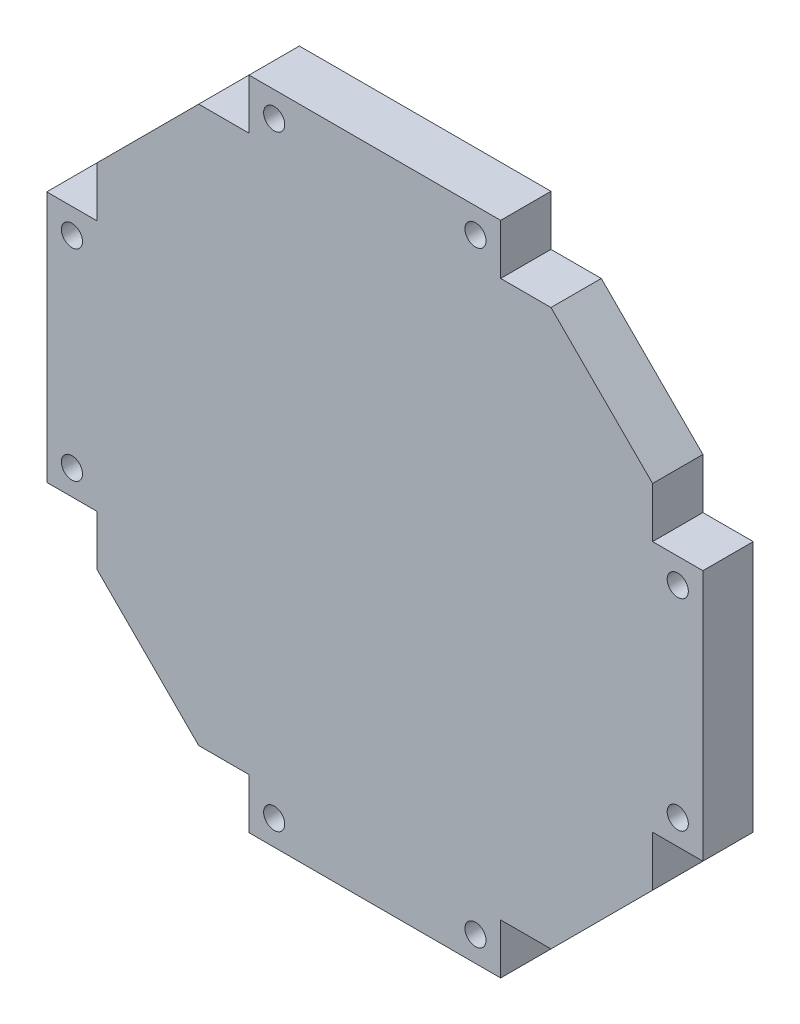
ISO-10303-21;
HEADER;
FILE_DESCRIPTION(('STEP AP214'),'2;1');
FILE_NAME('part.step','',(''),(''),'','','');
FILE_SCHEMA(('AUTOMOTIVE_DESIGN { 1 0 10303 214 1 1 1 1 }'));
ENDSEC;
DATA;
#1=APPLICATION_CONTEXT('core data for automotive mechanical design processes');
#2=APPLICATION_PROTOCOL_DEFINITION('international standard','automotive_design',2000,#1);
#3=PRODUCT_CONTEXT('',#1,'mechanical');
#4=PRODUCT('Part','Part','',(#3));
#5=PRODUCT_RELATED_PRODUCT_CATEGORY('part','',(#4));
#6=PRODUCT_DEFINITION_FORMATION('','',#4);
#7=PRODUCT_DEFINITION_CONTEXT('part definition',#1,'design');
#8=PRODUCT_DEFINITION('design','',#6,#7);
#9=PRODUCT_DEFINITION_SHAPE('','',#8);
#10=(LENGTH_UNIT() NAMED_UNIT(*) SI_UNIT(.MILLI.,.METRE.));
#11=(NAMED_UNIT(*) PLANE_ANGLE_UNIT() SI_UNIT($,.RADIAN.));
#12=(NAMED_UNIT(*) SI_UNIT($,.STERADIAN.) SOLID_ANGLE_UNIT());
#13=UNCERTAINTY_MEASURE_WITH_UNIT(LENGTH_MEASURE(1.E-05),#10,'distance_accuracy_value','');
#14=(GEOMETRIC_REPRESENTATION_CONTEXT(3) GLOBAL_UNCERTAINTY_ASSIGNED_CONTEXT((#13)) GLOBAL_UNIT_ASSIGNED_CONTEXT((#10,
#11,#12)) REPRESENTATION_CONTEXT('',''));
#15=CARTESIAN_POINT('',(0.,0.,0.));
#16=DIRECTION('',(0.,0.,1.));
#17=DIRECTION('',(1.,0.,0.));
#18=AXIS2_PLACEMENT_3D('',#15,#16,#17);
#19=CARTESIAN_POINT('',(0.,0.,10.));
#20=DIRECTION('',(0.,0.,1.));
#21=DIRECTION('',(1.,0.,0.));
#22=AXIS2_PLACEMENT_3D('',#19,#20,#21);
#23=PLANE('',#22);
#24=CARTESIAN_POINT('',(-20.,60.19,10.));
#25=DIRECTION('',(0.,0.,-1.));
#26=DIRECTION('',(-1.,0.,0.));
#27=AXIS2_PLACEMENT_3D('',#24,#25,#26);
#28=CIRCLE('',#27,2.1);
#29=CARTESIAN_POINT('',(-22.1,60.19,10.));
#30=VERTEX_POINT('',#29);
#31=EDGE_CURVE('E227',#30,#30,#28,.T.);
#32=ORIENTED_EDGE('',*,*,#31,.T.);
#33=EDGE_LOOP('',(#32));
#34=FACE_BOUND('',#33,.T.);
#35=CARTESIAN_POINT('',(20.,-60.19,10.));
#36=DIRECTION('',(0.,0.,-1.));
#37=DIRECTION('',(-1.,0.,0.));
#38=AXIS2_PLACEMENT_3D('',#35,#36,#37);
#39=CIRCLE('',#38,2.1);
#40=CARTESIAN_POINT('',(17.9,-60.19,10.));
#41=VERTEX_POINT('',#40);
#42=EDGE_CURVE('E230',#41,#41,#39,.T.);
#43=ORIENTED_EDGE('',*,*,#42,.T.);
#44=EDGE_LOOP('',(#43));
#45=FACE_BOUND('',#44,.T.);
#46=CARTESIAN_POINT('',(-60.19,20.,10.));
#47=DIRECTION('',(0.,0.,-1.));
#48=DIRECTION('',(-1.,0.,0.));
#49=AXIS2_PLACEMENT_3D('',#46,#47,#48);
#50=CIRCLE('',#49,2.1);
#51=CARTESIAN_POINT('',(-62.29,20.,10.));
#52=VERTEX_POINT('',#51);
#53=EDGE_CURVE('E233',#52,#52,#50,.T.);
#54=ORIENTED_EDGE('',*,*,#53,.T.);
#55=EDGE_LOOP('',(#54));
#56=FACE_BOUND('',#55,.T.);
#57=CARTESIAN_POINT('',(60.19,-20.,10.));
#58=DIRECTION('',(0.,0.,-1.));
#59=DIRECTION('',(-1.,0.,0.));
#60=AXIS2_PLACEMENT_3D('',#57,#58,#59);
#61=CIRCLE('',#60,2.1);
#62=CARTESIAN_POINT('',(58.09,-20.,10.));
#63=VERTEX_POINT('',#62);
#64=EDGE_CURVE('E236',#63,#63,#61,.T.);
#65=ORIENTED_EDGE('',*,*,#64,.T.);
#66=EDGE_LOOP('',(#65));
#67=FACE_BOUND('',#66,.T.);
#68=CARTESIAN_POINT('',(20.,60.19,10.));
#69=DIRECTION('',(0.,0.,-1.));
#70=DIRECTION('',(-1.,0.,0.));
#71=AXIS2_PLACEMENT_3D('',#68,#69,#70);
#72=CIRCLE('',#71,2.1);
#73=CARTESIAN_POINT('',(17.9,60.19,10.));
#74=VERTEX_POINT('',#73);
#75=EDGE_CURVE('E239',#74,#74,#72,.T.);
#76=ORIENTED_EDGE('',*,*,#75,.T.);
#77=EDGE_LOOP('',(#76));
#78=FACE_BOUND('',#77,.T.);
#79=CARTESIAN_POINT('',(-20.,-60.19,10.));
#80=DIRECTION('',(0.,0.,-1.));
#81=DIRECTION('',(-1.,0.,0.));
#82=AXIS2_PLACEMENT_3D('',#79,#80,#81);
#83=CIRCLE('',#82,2.1);
#84=CARTESIAN_POINT('',(-22.1,-60.19,10.));
#85=VERTEX_POINT('',#84);
#86=EDGE_CURVE('E242',#85,#85,#83,.T.);
#87=ORIENTED_EDGE('',*,*,#86,.T.);
#88=EDGE_LOOP('',(#87));
#89=FACE_BOUND('',#88,.T.);
#90=CARTESIAN_POINT('',(-60.19,-20.,10.));
#91=DIRECTION('',(0.,0.,-1.));
#92=DIRECTION('',(-1.,0.,0.));
#93=AXIS2_PLACEMENT_3D('',#90,#91,#92);
#94=CIRCLE('',#93,2.1);
#95=CARTESIAN_POINT('',(-62.29,-20.,10.));
#96=VERTEX_POINT('',#95);
#97=EDGE_CURVE('E244',#96,#96,#94,.T.);
#98=ORIENTED_EDGE('',*,*,#97,.T.);
#99=EDGE_LOOP('',(#98));
#100=FACE_BOUND('',#99,.T.);
#101=CARTESIAN_POINT('',(60.19,20.,10.));
#102=DIRECTION('',(0.,0.,-1.));
#103=DIRECTION('',(-1.,0.,0.));
#104=AXIS2_PLACEMENT_3D('',#101,#102,#103);
#105=CIRCLE('',#104,2.1);
#106=CARTESIAN_POINT('',(58.09,20.,10.));
#107=VERTEX_POINT('',#106);
#108=EDGE_CURVE('E20',#107,#107,#105,.T.);
#109=ORIENTED_EDGE('',*,*,#108,.T.);
#110=EDGE_LOOP('',(#109));
#111=FACE_BOUND('',#110,.T.);
#112=DIRECTION('',(1.,0.,0.));
#113=VECTOR('',#112,1.);
#114=CARTESIAN_POINT('',(-65.19,-25.,10.));
#115=LINE('',#114,#113);
#116=CARTESIAN_POINT('',(-55.19,-25.,10.));
#117=VERTEX_POINT('',#116);
#118=CARTESIAN_POINT('',(-65.19,-25.,10.));
#119=VERTEX_POINT('',#118);
#120=EDGE_CURVE('E264',#117,#119,#115,.F.);
#121=ORIENTED_EDGE('',*,*,#120,.F.);
#122=DIRECTION('',(0.,1.,0.));
#123=VECTOR('',#122,1.);
#124=CARTESIAN_POINT('',(-55.19,-25.,10.));
#125=LINE('',#124,#123);
#126=CARTESIAN_POINT('',(-55.19,-35.,10.));
#127=VERTEX_POINT('',#126);
#128=EDGE_CURVE('E260',#127,#117,#125,.T.);
#129=ORIENTED_EDGE('',*,*,#128,.F.);
#130=DIRECTION('',(0.707106781186548,-0.707106781186547,0.));
#131=VECTOR('',#130,1.);
#132=CARTESIAN_POINT('',(-45.095,-45.095,10.));
#133=LINE('',#132,#131);
#134=CARTESIAN_POINT('',(-35.,-55.19,10.));
#135=VERTEX_POINT('',#134);
#136=EDGE_CURVE('E194',#135,#127,#133,.F.);
#137=ORIENTED_EDGE('',*,*,#136,.F.);
#138=DIRECTION('',(1.,0.,0.));
#139=VECTOR('',#138,1.);
#140=CARTESIAN_POINT('',(-55.19,-55.19,10.));
#141=LINE('',#140,#139);
#142=CARTESIAN_POINT('',(-25.,-55.19,10.));
#143=VERTEX_POINT('',#142);
#144=EDGE_CURVE('E189',#143,#135,#141,.F.);
#145=ORIENTED_EDGE('',*,*,#144,.F.);
#146=DIRECTION('',(0.,-1.,0.));
#147=VECTOR('',#146,1.);
#148=CARTESIAN_POINT('',(-25.,-55.19,10.));
#149=LINE('',#148,#147);
#150=CARTESIAN_POINT('',(-25.,-65.19,10.));
#151=VERTEX_POINT('',#150);
#152=EDGE_CURVE('E180',#151,#143,#149,.F.);
#153=ORIENTED_EDGE('',*,*,#152,.F.);
#154=DIRECTION('',(1.,0.,0.));
#155=VECTOR('',#154,1.);
#156=CARTESIAN_POINT('',(-25.,-65.19,10.));
#157=LINE('',#156,#155);
#158=CARTESIAN_POINT('',(25.,-65.19,10.));
#159=VERTEX_POINT('',#158);
#160=EDGE_CURVE('E175',#159,#151,#157,.F.);
#161=ORIENTED_EDGE('',*,*,#160,.F.);
#162=DIRECTION('',(0.,1.,0.));
#163=VECTOR('',#162,1.);
#164=CARTESIAN_POINT('',(25.,-65.19,10.));
#165=LINE('',#164,#163);
#166=CARTESIAN_POINT('',(25.,-55.19,10.));
#167=VERTEX_POINT('',#166);
#168=EDGE_CURVE('E339',#167,#159,#165,.F.);
#169=ORIENTED_EDGE('',*,*,#168,.F.);
#170=DIRECTION('',(1.,0.,0.));
#171=VECTOR('',#170,1.);
#172=CARTESIAN_POINT('',(25.,-55.19,10.));
#173=LINE('',#172,#171);
#174=CARTESIAN_POINT('',(35.,-55.19,10.));
#175=VERTEX_POINT('',#174);
#176=EDGE_CURVE('E335',#175,#167,#173,.F.);
#177=ORIENTED_EDGE('',*,*,#176,.F.);
#178=DIRECTION('',(0.707106781186547,0.707106781186548,0.));
#179=VECTOR('',#178,1.);
#180=CARTESIAN_POINT('',(45.095,-45.095,10.));
#181=LINE('',#180,#179);
#182=CARTESIAN_POINT('',(55.19,-35.,10.));
#183=VERTEX_POINT('',#182);
#184=EDGE_CURVE('E331',#183,#175,#181,.F.);
#185=ORIENTED_EDGE('',*,*,#184,.F.);
#186=DIRECTION('',(0.,1.,0.));
#187=VECTOR('',#186,1.);
#188=CARTESIAN_POINT('',(55.19,-55.19,10.));
#189=LINE('',#188,#187);
#190=CARTESIAN_POINT('',(55.19,-25.,10.));
#191=VERTEX_POINT('',#190);
#192=EDGE_CURVE('E324',#191,#183,#189,.F.);
#193=ORIENTED_EDGE('',*,*,#192,.F.);
#194=DIRECTION('',(1.,0.,0.));
#195=VECTOR('',#194,1.);
#196=CARTESIAN_POINT('',(55.19,-25.,10.));
#197=LINE('',#196,#195);
#198=CARTESIAN_POINT('',(65.19,-25.,10.));
#199=VERTEX_POINT('',#198);
#200=EDGE_CURVE('E322',#199,#191,#197,.F.);
#201=ORIENTED_EDGE('',*,*,#200,.F.);
#202=DIRECTION('',(0.,1.,0.));
#203=VECTOR('',#202,1.);
#204=CARTESIAN_POINT('',(65.19,-25.,10.));
#205=LINE('',#204,#203);
#206=CARTESIAN_POINT('',(65.19,25.,10.));
#207=VERTEX_POINT('',#206);
#208=EDGE_CURVE('E318',#207,#199,#205,.F.);
#209=ORIENTED_EDGE('',*,*,#208,.F.);
#210=DIRECTION('',(1.,0.,0.));
#211=VECTOR('',#210,1.);
#212=CARTESIAN_POINT('',(65.19,25.,10.));
#213=LINE('',#212,#211);
#214=CARTESIAN_POINT('',(55.19,25.,10.));
#215=VERTEX_POINT('',#214);
#216=EDGE_CURVE('E314',#215,#207,#213,.T.);
#217=ORIENTED_EDGE('',*,*,#216,.F.);
#218=DIRECTION('',(0.,1.,0.));
#219=VECTOR('',#218,1.);
#220=CARTESIAN_POINT('',(55.19,25.,10.));
#221=LINE('',#220,#219);
#222=CARTESIAN_POINT('',(55.19,35.,10.));
#223=VERTEX_POINT('',#222);
#224=EDGE_CURVE('E310',#223,#215,#221,.F.);
#225=ORIENTED_EDGE('',*,*,#224,.F.);
#226=DIRECTION('',(-0.707106781186548,0.707106781186547,0.));
#227=VECTOR('',#226,1.);
#228=CARTESIAN_POINT('',(45.095,45.095,10.));
#229=LINE('',#228,#227);
#230=CARTESIAN_POINT('',(35.,55.19,10.));
#231=VERTEX_POINT('',#230);
#232=EDGE_CURVE('E306',#231,#223,#229,.F.);
#233=ORIENTED_EDGE('',*,*,#232,.F.);
#234=DIRECTION('',(-1.,0.,0.));
#235=VECTOR('',#234,1.);
#236=CARTESIAN_POINT('',(55.19,55.19,10.));
#237=LINE('',#236,#235);
#238=CARTESIAN_POINT('',(25.,55.19,10.));
#239=VERTEX_POINT('',#238);
#240=EDGE_CURVE('E299',#239,#231,#237,.F.);
#241=ORIENTED_EDGE('',*,*,#240,.F.);
#242=DIRECTION('',(0.,1.,0.));
#243=VECTOR('',#242,1.);
#244=CARTESIAN_POINT('',(25.,55.19,10.));
#245=LINE('',#244,#243);
#246=CARTESIAN_POINT('',(25.,65.19,10.));
#247=VERTEX_POINT('',#246);
#248=EDGE_CURVE('E297',#247,#239,#245,.F.);
#249=ORIENTED_EDGE('',*,*,#248,.F.);
#250=DIRECTION('',(1.,0.,0.));
#251=VECTOR('',#250,1.);
#252=CARTESIAN_POINT('',(25.,65.19,10.));
#253=LINE('',#252,#251);
#254=CARTESIAN_POINT('',(-25.,65.19,10.));
#255=VERTEX_POINT('',#254);
#256=EDGE_CURVE('E293',#255,#247,#253,.T.);
#257=ORIENTED_EDGE('',*,*,#256,.F.);
#258=DIRECTION('',(0.,1.,0.));
#259=VECTOR('',#258,1.);
#260=CARTESIAN_POINT('',(-25.,65.19,10.));
#261=LINE('',#260,#259);
#262=CARTESIAN_POINT('',(-25.,55.19,10.));
#263=VERTEX_POINT('',#262);
#264=EDGE_CURVE('E289',#263,#255,#261,.T.);
#265=ORIENTED_EDGE('',*,*,#264,.F.);
#266=DIRECTION('',(1.,0.,0.));
#267=VECTOR('',#266,1.);
#268=CARTESIAN_POINT('',(-25.,55.19,10.));
#269=LINE('',#268,#267);
#270=CARTESIAN_POINT('',(-35.,55.19,10.));
#271=VERTEX_POINT('',#270);
#272=EDGE_CURVE('E285',#271,#263,#269,.T.);
#273=ORIENTED_EDGE('',*,*,#272,.F.);
#274=DIRECTION('',(-0.707106781186547,-0.707106781186548,0.));
#275=VECTOR('',#274,1.);
#276=CARTESIAN_POINT('',(-45.095,45.095,10.));
#277=LINE('',#276,#275);
#278=CARTESIAN_POINT('',(-55.19,35.,10.));
#279=VERTEX_POINT('',#278);
#280=EDGE_CURVE('E281',#279,#271,#277,.F.);
#281=ORIENTED_EDGE('',*,*,#280,.F.);
#282=DIRECTION('',(0.,-1.,0.));
#283=VECTOR('',#282,1.);
#284=CARTESIAN_POINT('',(-55.19,55.19,10.));
#285=LINE('',#284,#283);
#286=CARTESIAN_POINT('',(-55.19,25.,10.));
#287=VERTEX_POINT('',#286);
#288=EDGE_CURVE('E274',#287,#279,#285,.F.);
#289=ORIENTED_EDGE('',*,*,#288,.F.);
#290=DIRECTION('',(-1.,0.,0.));
#291=VECTOR('',#290,1.);
#292=CARTESIAN_POINT('',(-55.19,25.,10.));
#293=LINE('',#292,#291);
#294=CARTESIAN_POINT('',(-65.19,25.,10.));
#295=VERTEX_POINT('',#294);
#296=EDGE_CURVE('E272',#295,#287,#293,.F.);
#297=ORIENTED_EDGE('',*,*,#296,.F.);
#298=DIRECTION('',(0.,-1.,0.));
#299=VECTOR('',#298,1.);
#300=CARTESIAN_POINT('',(-65.19,25.,10.));
#301=LINE('',#300,#299);
#302=EDGE_CURVE('E268',#119,#295,#301,.F.);
#303=ORIENTED_EDGE('',*,*,#302,.F.);
#304=EDGE_LOOP('',(#121,#129,#137,#145,#153,#161,#169,#177,#185,#193,#201,#209,#217,#225,#233,
#241,#249,#257,#265,#273,#281,#289,#297,#303));
#305=FACE_BOUND('',#304,.T.);
#306=ADVANCED_FACE('F17',(#34,#45,#56,#67,#78,#89,#100,#111,#305),#23,.T.);
#307=CARTESIAN_POINT('',(-55.19,-55.19,0.));
#308=DIRECTION('',(0.,-1.,0.));
#309=DIRECTION('',(1.,0.,0.));
#310=AXIS2_PLACEMENT_3D('',#307,#308,#309);
#311=PLANE('',#310);
#312=DIRECTION('',(0.,0.,1.));
#313=VECTOR('',#312,1.);
#314=CARTESIAN_POINT('',(-25.,-55.19,0.));
#315=LINE('',#314,#313);
#316=CARTESIAN_POINT('',(-25.,-55.19,0.));
#317=VERTEX_POINT('',#316);
#318=EDGE_CURVE('E185',#143,#317,#315,.F.);
#319=ORIENTED_EDGE('',*,*,#318,.F.);
#320=ORIENTED_EDGE('',*,*,#144,.T.);
#321=DIRECTION('',(0.,0.,1.));
#322=VECTOR('',#321,1.);
#323=CARTESIAN_POINT('',(-35.,-55.19,0.));
#324=LINE('',#323,#322);
#325=CARTESIAN_POINT('',(-35.,-55.19,0.));
#326=VERTEX_POINT('',#325);
#327=EDGE_CURVE('E249',#326,#135,#324,.T.);
#328=ORIENTED_EDGE('',*,*,#327,.F.);
#329=DIRECTION('',(1.,0.,0.));
#330=VECTOR('',#329,1.);
#331=CARTESIAN_POINT('',(0.,-55.19,0.));
#332=LINE('',#331,#330);
#333=EDGE_CURVE('E201',#326,#317,#332,.T.);
#334=ORIENTED_EDGE('',*,*,#333,.T.);
#335=EDGE_LOOP('',(#319,#320,#328,#334));
#336=FACE_BOUND('',#335,.T.);
#337=ADVANCED_FACE('F200',(#336),#311,.T.);
#338=CARTESIAN_POINT('',(-25.,-55.19,0.));
#339=DIRECTION('',(-1.,0.,0.));
#340=DIRECTION('',(0.,-1.,0.));
#341=AXIS2_PLACEMENT_3D('',#338,#339,#340);
#342=PLANE('',#341);
#343=ORIENTED_EDGE('',*,*,#152,.T.);
#344=ORIENTED_EDGE('',*,*,#318,.T.);
#345=DIRECTION('',(0.,1.,0.));
#346=VECTOR('',#345,1.);
#347=CARTESIAN_POINT('',(-25.,0.,0.));
#348=LINE('',#347,#346);
#349=CARTESIAN_POINT('',(-25.,-65.19,0.));
#350=VERTEX_POINT('',#349);
#351=EDGE_CURVE('E348',#317,#350,#348,.F.);
#352=ORIENTED_EDGE('',*,*,#351,.T.);
#353=DIRECTION('',(0.,0.,1.));
#354=VECTOR('',#353,1.);
#355=CARTESIAN_POINT('',(-25.,-65.19,0.));
#356=LINE('',#355,#354);
#357=EDGE_CURVE('E187',#151,#350,#356,.F.);
#358=ORIENTED_EDGE('',*,*,#357,.F.);
#359=EDGE_LOOP('',(#343,#344,#352,#358));
#360=FACE_BOUND('',#359,.T.);
#361=ADVANCED_FACE('F182',(#360),#342,.T.);
#362=CARTESIAN_POINT('',(-25.,-65.19,0.));
#363=DIRECTION('',(0.,-1.,0.));
#364=DIRECTION('',(1.,0.,0.));
#365=AXIS2_PLACEMENT_3D('',#362,#363,#364);
#366=PLANE('',#365);
#367=ORIENTED_EDGE('',*,*,#160,.T.);
#368=ORIENTED_EDGE('',*,*,#357,.T.);
#369=DIRECTION('',(1.,0.,0.));
#370=VECTOR('',#369,1.);
#371=CARTESIAN_POINT('',(0.,-65.19,0.));
#372=LINE('',#371,#370);
#373=CARTESIAN_POINT('',(25.,-65.19,0.));
#374=VERTEX_POINT('',#373);
#375=EDGE_CURVE('E343',#350,#374,#372,.T.);
#376=ORIENTED_EDGE('',*,*,#375,.T.);
#377=DIRECTION('',(0.,0.,-1.));
#378=VECTOR('',#377,1.);
#379=CARTESIAN_POINT('',(25.,-65.19,0.));
#380=LINE('',#379,#378);
#381=EDGE_CURVE('E337',#159,#374,#380,.T.);
#382=ORIENTED_EDGE('',*,*,#381,.F.);
#383=EDGE_LOOP('',(#367,#368,#376,#382));
#384=FACE_BOUND('',#383,.T.);
#385=ADVANCED_FACE('F342',(#384),#366,.T.);
#386=CARTESIAN_POINT('',(25.,-65.19,0.));
#387=DIRECTION('',(1.,0.,0.));
#388=DIRECTION('',(0.,0.,-1.));
#389=AXIS2_PLACEMENT_3D('',#386,#387,#388);
#390=PLANE('',#389);
#391=ORIENTED_EDGE('',*,*,#168,.T.);
#392=ORIENTED_EDGE('',*,*,#381,.T.);
#393=DIRECTION('',(0.,1.,0.));
#394=VECTOR('',#393,1.);
#395=CARTESIAN_POINT('',(25.,0.,0.));
#396=LINE('',#395,#394);
#397=CARTESIAN_POINT('',(25.,-55.19,0.));
#398=VERTEX_POINT('',#397);
#399=EDGE_CURVE('E351',#374,#398,#396,.T.);
#400=ORIENTED_EDGE('',*,*,#399,.T.);
#401=DIRECTION('',(0.,0.,-1.));
#402=VECTOR('',#401,1.);
#403=CARTESIAN_POINT('',(25.,-55.19,0.));
#404=LINE('',#403,#402);
#405=EDGE_CURVE('E333',#167,#398,#404,.T.);
#406=ORIENTED_EDGE('',*,*,#405,.F.);
#407=EDGE_LOOP('',(#391,#392,#400,#406));
#408=FACE_BOUND('',#407,.T.);
#409=ADVANCED_FACE('F503',(#408),#390,.T.);
#410=CARTESIAN_POINT('',(25.,-55.19,0.));
#411=DIRECTION('',(0.,-1.,0.));
#412=DIRECTION('',(0.,0.,-1.));
#413=AXIS2_PLACEMENT_3D('',#410,#411,#412);
#414=PLANE('',#413);
#415=ORIENTED_EDGE('',*,*,#405,.T.);
#416=DIRECTION('',(1.,0.,0.));
#417=VECTOR('',#416,1.);
#418=CARTESIAN_POINT('',(0.,-55.19,0.));
#419=LINE('',#418,#417);
#420=CARTESIAN_POINT('',(35.,-55.19,0.));
#421=VERTEX_POINT('',#420);
#422=EDGE_CURVE('E355',#398,#421,#419,.T.);
#423=ORIENTED_EDGE('',*,*,#422,.T.);
#424=DIRECTION('',(0.,0.,1.));
#425=VECTOR('',#424,1.);
#426=CARTESIAN_POINT('',(35.,-55.19,0.));
#427=LINE('',#426,#425);
#428=EDGE_CURVE('E329',#175,#421,#427,.F.);
#429=ORIENTED_EDGE('',*,*,#428,.F.);
#430=ORIENTED_EDGE('',*,*,#176,.T.);
#431=EDGE_LOOP('',(#415,#423,#429,#430));
#432=FACE_BOUND('',#431,.T.);
#433=ADVANCED_FACE('F499',(#432),#414,.T.);
#434=CARTESIAN_POINT('',(45.095,-45.095,0.));
#435=DIRECTION('',(0.707106781186548,-0.707106781186547,0.));
#436=DIRECTION('',(0.707106781186547,0.707106781186548,0.));
#437=AXIS2_PLACEMENT_3D('',#434,#435,#436);
#438=PLANE('',#437);
#439=DIRECTION('',(0.707106781186548,0.707106781186548,0.));
#440=VECTOR('',#439,1.);
#441=CARTESIAN_POINT('',(35.,-55.19,0.));
#442=LINE('',#441,#440);
#443=CARTESIAN_POINT('',(55.19,-35.,0.));
#444=VERTEX_POINT('',#443);
#445=EDGE_CURVE('E358',#421,#444,#442,.T.);
#446=ORIENTED_EDGE('',*,*,#445,.T.);
#447=DIRECTION('',(0.,0.,1.));
#448=VECTOR('',#447,1.);
#449=CARTESIAN_POINT('',(55.19,-35.,0.));
#450=LINE('',#449,#448);
#451=EDGE_CURVE('E327',#183,#444,#450,.F.);
#452=ORIENTED_EDGE('',*,*,#451,.F.);
#453=ORIENTED_EDGE('',*,*,#184,.T.);
#454=ORIENTED_EDGE('',*,*,#428,.T.);
#455=EDGE_LOOP('',(#446,#452,#453,#454));
#456=FACE_BOUND('',#455,.T.);
#457=ADVANCED_FACE('F495',(#456),#438,.T.);
#458=CARTESIAN_POINT('',(55.19,-55.19,0.));
#459=DIRECTION('',(1.,0.,0.));
#460=DIRECTION('',(0.,1.,0.));
#461=AXIS2_PLACEMENT_3D('',#458,#459,#460);
#462=PLANE('',#461);
#463=DIRECTION('',(0.,0.,1.));
#464=VECTOR('',#463,1.);
#465=CARTESIAN_POINT('',(55.19,-25.,0.));
#466=LINE('',#465,#464);
#467=CARTESIAN_POINT('',(55.19,-25.,0.));
#468=VERTEX_POINT('',#467);
#469=EDGE_CURVE('E320',#191,#468,#466,.F.);
#470=ORIENTED_EDGE('',*,*,#469,.F.);
#471=ORIENTED_EDGE('',*,*,#192,.T.);
#472=ORIENTED_EDGE('',*,*,#451,.T.);
#473=DIRECTION('',(0.,1.,0.));
#474=VECTOR('',#473,1.);
#475=CARTESIAN_POINT('',(55.19,0.,0.));
#476=LINE('',#475,#474);
#477=EDGE_CURVE('E361',#444,#468,#476,.T.);
#478=ORIENTED_EDGE('',*,*,#477,.T.);
#479=EDGE_LOOP('',(#470,#471,#472,#478));
#480=FACE_BOUND('',#479,.T.);
#481=ADVANCED_FACE('F492',(#480),#462,.T.);
#482=CARTESIAN_POINT('',(55.19,-25.,0.));
#483=DIRECTION('',(0.,-1.,0.));
#484=DIRECTION('',(1.,0.,0.));
#485=AXIS2_PLACEMENT_3D('',#482,#483,#484);
#486=PLANE('',#485);
#487=ORIENTED_EDGE('',*,*,#200,.T.);
#488=ORIENTED_EDGE('',*,*,#469,.T.);
#489=DIRECTION('',(1.,0.,0.));
#490=VECTOR('',#489,1.);
#491=CARTESIAN_POINT('',(0.,-25.,0.));
#492=LINE('',#491,#490);
#493=CARTESIAN_POINT('',(65.19,-25.,0.));
#494=VERTEX_POINT('',#493);
#495=EDGE_CURVE('E364',#468,#494,#492,.T.);
#496=ORIENTED_EDGE('',*,*,#495,.T.);
#497=DIRECTION('',(0.,0.,1.));
#498=VECTOR('',#497,1.);
#499=CARTESIAN_POINT('',(65.19,-25.,0.));
#500=LINE('',#499,#498);
#501=EDGE_CURVE('E316',#199,#494,#500,.F.);
#502=ORIENTED_EDGE('',*,*,#501,.F.);
#503=EDGE_LOOP('',(#487,#488,#496,#502));
#504=FACE_BOUND('',#503,.T.);
#505=ADVANCED_FACE('F486',(#504),#486,.T.);
#506=CARTESIAN_POINT('',(65.19,-25.,0.));
#507=DIRECTION('',(1.,0.,0.));
#508=DIRECTION('',(0.,1.,0.));
#509=AXIS2_PLACEMENT_3D('',#506,#507,#508);
#510=PLANE('',#509);
#511=ORIENTED_EDGE('',*,*,#208,.T.);
#512=ORIENTED_EDGE('',*,*,#501,.T.);
#513=DIRECTION('',(0.,1.,0.));
#514=VECTOR('',#513,1.);
#515=CARTESIAN_POINT('',(65.19,0.,0.));
#516=LINE('',#515,#514);
#517=CARTESIAN_POINT('',(65.19,25.,0.));
#518=VERTEX_POINT('',#517);
#519=EDGE_CURVE('E367',#494,#518,#516,.T.);
#520=ORIENTED_EDGE('',*,*,#519,.T.);
#521=DIRECTION('',(0.,0.,1.));
#522=VECTOR('',#521,1.);
#523=CARTESIAN_POINT('',(65.19,25.,0.));
#524=LINE('',#523,#522);
#525=EDGE_CURVE('E312',#207,#518,#524,.F.);
#526=ORIENTED_EDGE('',*,*,#525,.F.);
#527=EDGE_LOOP('',(#511,#512,#520,#526));
#528=FACE_BOUND('',#527,.T.);
#529=ADVANCED_FACE('F482',(#528),#510,.T.);
#530=CARTESIAN_POINT('',(65.19,25.,0.));
#531=DIRECTION('',(0.,1.,0.));
#532=DIRECTION('',(0.,0.,1.));
#533=AXIS2_PLACEMENT_3D('',#530,#531,#532);
#534=PLANE('',#533);
#535=ORIENTED_EDGE('',*,*,#216,.T.);
#536=ORIENTED_EDGE('',*,*,#525,.T.);
#537=DIRECTION('',(1.,0.,0.));
#538=VECTOR('',#537,1.);
#539=CARTESIAN_POINT('',(0.,25.,0.));
#540=LINE('',#539,#538);
#541=CARTESIAN_POINT('',(55.19,25.,0.));
#542=VERTEX_POINT('',#541);
#543=EDGE_CURVE('E370',#518,#542,#540,.F.);
#544=ORIENTED_EDGE('',*,*,#543,.T.);
#545=DIRECTION('',(0.,0.,-1.));
#546=VECTOR('',#545,1.);
#547=CARTESIAN_POINT('',(55.19,25.,0.));
#548=LINE('',#547,#546);
#549=EDGE_CURVE('E308',#215,#542,#548,.T.);
#550=ORIENTED_EDGE('',*,*,#549,.F.);
#551=EDGE_LOOP('',(#535,#536,#544,#550));
#552=FACE_BOUND('',#551,.T.);
#553=ADVANCED_FACE('F476',(#552),#534,.T.);
#554=CARTESIAN_POINT('',(55.19,25.,0.));
#555=DIRECTION('',(1.,0.,0.));
#556=DIRECTION('',(0.,0.,-1.));
#557=AXIS2_PLACEMENT_3D('',#554,#555,#556);
#558=PLANE('',#557);
#559=ORIENTED_EDGE('',*,*,#549,.T.);
#560=DIRECTION('',(0.,1.,0.));
#561=VECTOR('',#560,1.);
#562=CARTESIAN_POINT('',(55.19,0.,0.));
#563=LINE('',#562,#561);
#564=CARTESIAN_POINT('',(55.19,35.,0.));
#565=VERTEX_POINT('',#564);
#566=EDGE_CURVE('E373',#542,#565,#563,.T.);
#567=ORIENTED_EDGE('',*,*,#566,.T.);
#568=DIRECTION('',(0.,0.,1.));
#569=VECTOR('',#568,1.);
#570=CARTESIAN_POINT('',(55.19,35.,0.));
#571=LINE('',#570,#569);
#572=EDGE_CURVE('E304',#223,#565,#571,.F.);
#573=ORIENTED_EDGE('',*,*,#572,.F.);
#574=ORIENTED_EDGE('',*,*,#224,.T.);
#575=EDGE_LOOP('',(#559,#567,#573,#574));
#576=FACE_BOUND('',#575,.T.);
#577=ADVANCED_FACE('F472',(#576),#558,.T.);
#578=CARTESIAN_POINT('',(45.095,45.095,0.));
#579=DIRECTION('',(0.707106781186547,0.707106781186548,0.));
#580=DIRECTION('',(-0.707106781186548,0.707106781186547,0.));
#581=AXIS2_PLACEMENT_3D('',#578,#579,#580);
#582=PLANE('',#581);
#583=DIRECTION('',(-0.707106781186548,0.707106781186548,0.));
#584=VECTOR('',#583,1.);
#585=CARTESIAN_POINT('',(55.19,35.,0.));
#586=LINE('',#585,#584);
#587=CARTESIAN_POINT('',(35.,55.19,0.));
#588=VERTEX_POINT('',#587);
#589=EDGE_CURVE('E376',#565,#588,#586,.T.);
#590=ORIENTED_EDGE('',*,*,#589,.T.);
#591=DIRECTION('',(0.,0.,1.));
#592=VECTOR('',#591,1.);
#593=CARTESIAN_POINT('',(35.,55.19,0.));
#594=LINE('',#593,#592);
#595=EDGE_CURVE('E302',#231,#588,#594,.F.);
#596=ORIENTED_EDGE('',*,*,#595,.F.);
#597=ORIENTED_EDGE('',*,*,#232,.T.);
#598=ORIENTED_EDGE('',*,*,#572,.T.);
#599=EDGE_LOOP('',(#590,#596,#597,#598));
#600=FACE_BOUND('',#599,.T.);
#601=ADVANCED_FACE('F466',(#600),#582,.T.);
#602=CARTESIAN_POINT('',(55.19,55.19,0.));
#603=DIRECTION('',(0.,1.,0.));
#604=DIRECTION('',(-1.,0.,0.));
#605=AXIS2_PLACEMENT_3D('',#602,#603,#604);
#606=PLANE('',#605);
#607=DIRECTION('',(0.,0.,1.));
#608=VECTOR('',#607,1.);
#609=CARTESIAN_POINT('',(25.,55.19,0.));
#610=LINE('',#609,#608);
#611=CARTESIAN_POINT('',(25.,55.19,0.));
#612=VERTEX_POINT('',#611);
#613=EDGE_CURVE('E295',#239,#612,#610,.F.);
#614=ORIENTED_EDGE('',*,*,#613,.F.);
#615=ORIENTED_EDGE('',*,*,#240,.T.);
#616=ORIENTED_EDGE('',*,*,#595,.T.);
#617=DIRECTION('',(1.,0.,0.));
#618=VECTOR('',#617,1.);
#619=CARTESIAN_POINT('',(0.,55.19,0.));
#620=LINE('',#619,#618);
#621=EDGE_CURVE('E379',#588,#612,#620,.F.);
#622=ORIENTED_EDGE('',*,*,#621,.T.);
#623=EDGE_LOOP('',(#614,#615,#616,#622));
#624=FACE_BOUND('',#623,.T.);
#625=ADVANCED_FACE('F463',(#624),#606,.T.);
#626=CARTESIAN_POINT('',(25.,55.19,0.));
#627=DIRECTION('',(1.,0.,0.));
#628=DIRECTION('',(0.,1.,0.));
#629=AXIS2_PLACEMENT_3D('',#626,#627,#628);
#630=PLANE('',#629);
#631=ORIENTED_EDGE('',*,*,#248,.T.);
#632=ORIENTED_EDGE('',*,*,#613,.T.);
#633=DIRECTION('',(0.,1.,0.));
#634=VECTOR('',#633,1.);
#635=CARTESIAN_POINT('',(25.,0.,0.));
#636=LINE('',#635,#634);
#637=CARTESIAN_POINT('',(25.,65.19,0.));
#638=VERTEX_POINT('',#637);
#639=EDGE_CURVE('E382',#612,#638,#636,.T.);
#640=ORIENTED_EDGE('',*,*,#639,.T.);
#641=DIRECTION('',(0.,0.,1.));
#642=VECTOR('',#641,1.);
#643=CARTESIAN_POINT('',(25.,65.19,0.));
#644=LINE('',#643,#642);
#645=EDGE_CURVE('E291',#247,#638,#644,.F.);
#646=ORIENTED_EDGE('',*,*,#645,.F.);
#647=EDGE_LOOP('',(#631,#632,#640,#646));
#648=FACE_BOUND('',#647,.T.);
#649=ADVANCED_FACE('F457',(#648),#630,.T.);
#650=CARTESIAN_POINT('',(25.,65.19,0.));
#651=DIRECTION('',(0.,1.,0.));
#652=DIRECTION('',(0.,0.,1.));
#653=AXIS2_PLACEMENT_3D('',#650,#651,#652);
#654=PLANE('',#653);
#655=ORIENTED_EDGE('',*,*,#256,.T.);
#656=ORIENTED_EDGE('',*,*,#645,.T.);
#657=DIRECTION('',(1.,0.,0.));
#658=VECTOR('',#657,1.);
#659=CARTESIAN_POINT('',(0.,65.19,0.));
#660=LINE('',#659,#658);
#661=CARTESIAN_POINT('',(-25.,65.19,0.));
#662=VERTEX_POINT('',#661);
#663=EDGE_CURVE('E385',#638,#662,#660,.F.);
#664=ORIENTED_EDGE('',*,*,#663,.T.);
#665=DIRECTION('',(0.,0.,1.));
#666=VECTOR('',#665,1.);
#667=CARTESIAN_POINT('',(-25.,65.19,0.));
#668=LINE('',#667,#666);
#669=EDGE_CURVE('E287',#255,#662,#668,.F.);
#670=ORIENTED_EDGE('',*,*,#669,.F.);
#671=EDGE_LOOP('',(#655,#656,#664,#670));
#672=FACE_BOUND('',#671,.T.);
#673=ADVANCED_FACE('F453',(#672),#654,.T.);
#674=CARTESIAN_POINT('',(-25.,65.19,0.));
#675=DIRECTION('',(-1.,0.,0.));
#676=DIRECTION('',(0.,0.,1.));
#677=AXIS2_PLACEMENT_3D('',#674,#675,#676);
#678=PLANE('',#677);
#679=ORIENTED_EDGE('',*,*,#264,.T.);
#680=ORIENTED_EDGE('',*,*,#669,.T.);
#681=DIRECTION('',(0.,1.,0.));
#682=VECTOR('',#681,1.);
#683=CARTESIAN_POINT('',(-25.,0.,0.));
#684=LINE('',#683,#682);
#685=CARTESIAN_POINT('',(-25.,55.19,0.));
#686=VERTEX_POINT('',#685);
#687=EDGE_CURVE('E388',#662,#686,#684,.F.);
#688=ORIENTED_EDGE('',*,*,#687,.T.);
#689=DIRECTION('',(0.,0.,1.));
#690=VECTOR('',#689,1.);
#691=CARTESIAN_POINT('',(-25.,55.19,0.));
#692=LINE('',#691,#690);
#693=EDGE_CURVE('E283',#263,#686,#692,.F.);
#694=ORIENTED_EDGE('',*,*,#693,.F.);
#695=EDGE_LOOP('',(#679,#680,#688,#694));
#696=FACE_BOUND('',#695,.T.);
#697=ADVANCED_FACE('F447',(#696),#678,.T.);
#698=CARTESIAN_POINT('',(-25.,55.19,0.));
#699=DIRECTION('',(0.,1.,0.));
#700=DIRECTION('',(0.,0.,1.));
#701=AXIS2_PLACEMENT_3D('',#698,#699,#700);
#702=PLANE('',#701);
#703=ORIENTED_EDGE('',*,*,#693,.T.);
#704=DIRECTION('',(1.,0.,0.));
#705=VECTOR('',#704,1.);
#706=CARTESIAN_POINT('',(0.,55.19,0.));
#707=LINE('',#706,#705);
#708=CARTESIAN_POINT('',(-35.,55.19,0.));
#709=VERTEX_POINT('',#708);
#710=EDGE_CURVE('E391',#686,#709,#707,.F.);
#711=ORIENTED_EDGE('',*,*,#710,.T.);
#712=DIRECTION('',(0.,0.,1.));
#713=VECTOR('',#712,1.);
#714=CARTESIAN_POINT('',(-35.,55.19,0.));
#715=LINE('',#714,#713);
#716=EDGE_CURVE('E279',#271,#709,#715,.F.);
#717=ORIENTED_EDGE('',*,*,#716,.F.);
#718=ORIENTED_EDGE('',*,*,#272,.T.);
#719=EDGE_LOOP('',(#703,#711,#717,#718));
#720=FACE_BOUND('',#719,.T.);
#721=ADVANCED_FACE('F443',(#720),#702,.T.);
#722=CARTESIAN_POINT('',(-45.095,45.095,0.));
#723=DIRECTION('',(-0.707106781186548,0.707106781186547,0.));
#724=DIRECTION('',(-0.707106781186547,-0.707106781186548,0.));
#725=AXIS2_PLACEMENT_3D('',#722,#723,#724);
#726=PLANE('',#725);
#727=DIRECTION('',(-0.707106781186548,-0.707106781186548,0.));
#728=VECTOR('',#727,1.);
#729=CARTESIAN_POINT('',(-35.,55.19,0.));
#730=LINE('',#729,#728);
#731=CARTESIAN_POINT('',(-55.19,35.,0.));
#732=VERTEX_POINT('',#731);
#733=EDGE_CURVE('E394',#709,#732,#730,.T.);
#734=ORIENTED_EDGE('',*,*,#733,.T.);
#735=DIRECTION('',(0.,0.,1.));
#736=VECTOR('',#735,1.);
#737=CARTESIAN_POINT('',(-55.19,35.,0.));
#738=LINE('',#737,#736);
#739=EDGE_CURVE('E277',#279,#732,#738,.F.);
#740=ORIENTED_EDGE('',*,*,#739,.F.);
#741=ORIENTED_EDGE('',*,*,#280,.T.);
#742=ORIENTED_EDGE('',*,*,#716,.T.);
#743=EDGE_LOOP('',(#734,#740,#741,#742));
#744=FACE_BOUND('',#743,.T.);
#745=ADVANCED_FACE('F437',(#744),#726,.T.);
#746=CARTESIAN_POINT('',(-55.19,55.19,0.));
#747=DIRECTION('',(-1.,0.,0.));
#748=DIRECTION('',(0.,-1.,0.));
#749=AXIS2_PLACEMENT_3D('',#746,#747,#748);
#750=PLANE('',#749);
#751=DIRECTION('',(0.,0.,1.));
#752=VECTOR('',#751,1.);
#753=CARTESIAN_POINT('',(-55.19,25.,0.));
#754=LINE('',#753,#752);
#755=CARTESIAN_POINT('',(-55.19,25.,0.));
#756=VERTEX_POINT('',#755);
#757=EDGE_CURVE('E270',#287,#756,#754,.F.);
#758=ORIENTED_EDGE('',*,*,#757,.F.);
#759=ORIENTED_EDGE('',*,*,#288,.T.);
#760=ORIENTED_EDGE('',*,*,#739,.T.);
#761=DIRECTION('',(0.,1.,0.));
#762=VECTOR('',#761,1.);
#763=CARTESIAN_POINT('',(-55.19,0.,0.));
#764=LINE('',#763,#762);
#765=EDGE_CURVE('E397',#732,#756,#764,.F.);
#766=ORIENTED_EDGE('',*,*,#765,.T.);
#767=EDGE_LOOP('',(#758,#759,#760,#766));
#768=FACE_BOUND('',#767,.T.);
#769=ADVANCED_FACE('F434',(#768),#750,.T.);
#770=CARTESIAN_POINT('',(-55.19,25.,0.));
#771=DIRECTION('',(0.,1.,0.));
#772=DIRECTION('',(-1.,0.,0.));
#773=AXIS2_PLACEMENT_3D('',#770,#771,#772);
#774=PLANE('',#773);
#775=ORIENTED_EDGE('',*,*,#296,.T.);
#776=ORIENTED_EDGE('',*,*,#757,.T.);
#777=DIRECTION('',(1.,0.,0.));
#778=VECTOR('',#777,1.);
#779=CARTESIAN_POINT('',(0.,25.,0.));
#780=LINE('',#779,#778);
#781=CARTESIAN_POINT('',(-65.19,25.,0.));
#782=VERTEX_POINT('',#781);
#783=EDGE_CURVE('E400',#756,#782,#780,.F.);
#784=ORIENTED_EDGE('',*,*,#783,.T.);
#785=DIRECTION('',(0.,0.,1.));
#786=VECTOR('',#785,1.);
#787=CARTESIAN_POINT('',(-65.19,25.,0.));
#788=LINE('',#787,#786);
#789=EDGE_CURVE('E266',#295,#782,#788,.F.);
#790=ORIENTED_EDGE('',*,*,#789,.F.);
#791=EDGE_LOOP('',(#775,#776,#784,#790));
#792=FACE_BOUND('',#791,.T.);
#793=ADVANCED_FACE('F428',(#792),#774,.T.);
#794=CARTESIAN_POINT('',(-65.19,25.,0.));
#795=DIRECTION('',(-1.,0.,0.));
#796=DIRECTION('',(0.,-1.,0.));
#797=AXIS2_PLACEMENT_3D('',#794,#795,#796);
#798=PLANE('',#797);
#799=ORIENTED_EDGE('',*,*,#302,.T.);
#800=ORIENTED_EDGE('',*,*,#789,.T.);
#801=DIRECTION('',(0.,1.,0.));
#802=VECTOR('',#801,1.);
#803=CARTESIAN_POINT('',(-65.19,0.,0.));
#804=LINE('',#803,#802);
#805=CARTESIAN_POINT('',(-65.19,-25.,0.));
#806=VERTEX_POINT('',#805);
#807=EDGE_CURVE('E403',#782,#806,#804,.F.);
#808=ORIENTED_EDGE('',*,*,#807,.T.);
#809=DIRECTION('',(0.,0.,-1.));
#810=VECTOR('',#809,1.);
#811=CARTESIAN_POINT('',(-65.19,-25.,0.));
#812=LINE('',#811,#810);
#813=EDGE_CURVE('E262',#119,#806,#812,.T.);
#814=ORIENTED_EDGE('',*,*,#813,.F.);
#815=EDGE_LOOP('',(#799,#800,#808,#814));
#816=FACE_BOUND('',#815,.T.);
#817=ADVANCED_FACE('F424',(#816),#798,.T.);
#818=CARTESIAN_POINT('',(-65.19,-25.,0.));
#819=DIRECTION('',(0.,-1.,0.));
#820=DIRECTION('',(0.,0.,-1.));
#821=AXIS2_PLACEMENT_3D('',#818,#819,#820);
#822=PLANE('',#821);
#823=ORIENTED_EDGE('',*,*,#120,.T.);
#824=ORIENTED_EDGE('',*,*,#813,.T.);
#825=DIRECTION('',(1.,0.,0.));
#826=VECTOR('',#825,1.);
#827=CARTESIAN_POINT('',(0.,-25.,0.));
#828=LINE('',#827,#826);
#829=CARTESIAN_POINT('',(-55.19,-25.,0.));
#830=VERTEX_POINT('',#829);
#831=EDGE_CURVE('E406',#806,#830,#828,.T.);
#832=ORIENTED_EDGE('',*,*,#831,.T.);
#833=DIRECTION('',(0.,0.,1.));
#834=VECTOR('',#833,1.);
#835=CARTESIAN_POINT('',(-55.19,-25.,0.));
#836=LINE('',#835,#834);
#837=EDGE_CURVE('E258',#117,#830,#836,.F.);
#838=ORIENTED_EDGE('',*,*,#837,.F.);
#839=EDGE_LOOP('',(#823,#824,#832,#838));
#840=FACE_BOUND('',#839,.T.);
#841=ADVANCED_FACE('F418',(#840),#822,.T.);
#842=CARTESIAN_POINT('',(-55.19,-25.,0.));
#843=DIRECTION('',(-1.,0.,0.));
#844=DIRECTION('',(0.,0.,1.));
#845=AXIS2_PLACEMENT_3D('',#842,#843,#844);
#846=PLANE('',#845);
#847=ORIENTED_EDGE('',*,*,#837,.T.);
#848=DIRECTION('',(0.,1.,0.));
#849=VECTOR('',#848,1.);
#850=CARTESIAN_POINT('',(-55.19,0.,0.));
#851=LINE('',#850,#849);
#852=CARTESIAN_POINT('',(-55.19,-35.,0.));
#853=VERTEX_POINT('',#852);
#854=EDGE_CURVE('E409',#830,#853,#851,.F.);
#855=ORIENTED_EDGE('',*,*,#854,.T.);
#856=DIRECTION('',(0.,0.,1.));
#857=VECTOR('',#856,1.);
#858=CARTESIAN_POINT('',(-55.19,-35.,0.));
#859=LINE('',#858,#857);
#860=EDGE_CURVE('E35',#127,#853,#859,.F.);
#861=ORIENTED_EDGE('',*,*,#860,.F.);
#862=ORIENTED_EDGE('',*,*,#128,.T.);
#863=EDGE_LOOP('',(#847,#855,#861,#862));
#864=FACE_BOUND('',#863,.T.);
#865=ADVANCED_FACE('F415',(#864),#846,.T.);
#866=CARTESIAN_POINT('',(-45.095,-45.095,0.));
#867=DIRECTION('',(-0.707106781186547,-0.707106781186548,0.));
#868=DIRECTION('',(0.707106781186548,-0.707106781186547,0.));
#869=AXIS2_PLACEMENT_3D('',#866,#867,#868);
#870=PLANE('',#869);
#871=DIRECTION('',(0.707106781186548,-0.707106781186548,0.));
#872=VECTOR('',#871,1.);
#873=CARTESIAN_POINT('',(-55.19,-35.,0.));
#874=LINE('',#873,#872);
#875=EDGE_CURVE('E226',#853,#326,#874,.T.);
#876=ORIENTED_EDGE('',*,*,#875,.T.);
#877=ORIENTED_EDGE('',*,*,#327,.T.);
#878=ORIENTED_EDGE('',*,*,#136,.T.);
#879=ORIENTED_EDGE('',*,*,#860,.T.);
#880=EDGE_LOOP('',(#876,#877,#878,#879));
#881=FACE_BOUND('',#880,.T.);
#882=ADVANCED_FACE('F412',(#881),#870,.T.);
#883=CARTESIAN_POINT('',(60.19,20.,10.));
#884=DIRECTION('',(0.,0.,-1.));
#885=DIRECTION('',(-1.,0.,0.));
#886=AXIS2_PLACEMENT_3D('',#883,#884,#885);
#887=CYLINDRICAL_SURFACE('',#886,2.1);
#888=CARTESIAN_POINT('',(60.19,20.,0.));
#889=DIRECTION('',(0.,0.,-1.));
#890=DIRECTION('',(-1.,0.,0.));
#891=AXIS2_PLACEMENT_3D('',#888,#889,#890);
#892=CIRCLE('',#891,2.1);
#893=CARTESIAN_POINT('',(58.09,20.,0.));
#894=VERTEX_POINT('',#893);
#895=EDGE_CURVE('E223',#894,#894,#892,.T.);
#896=ORIENTED_EDGE('',*,*,#895,.T.);
#897=EDGE_LOOP('',(#896));
#898=FACE_BOUND('',#897,.T.);
#899=ORIENTED_EDGE('',*,*,#108,.F.);
#900=EDGE_LOOP('',(#899));
#901=FACE_BOUND('',#900,.T.);
#902=ADVANCED_FACE('F548',(#898,#901),#887,.F.);
#903=CARTESIAN_POINT('',(-60.19,-20.,10.));
#904=DIRECTION('',(0.,0.,-1.));
#905=DIRECTION('',(-1.,0.,0.));
#906=AXIS2_PLACEMENT_3D('',#903,#904,#905);
#907=CYLINDRICAL_SURFACE('',#906,2.1);
#908=CARTESIAN_POINT('',(-60.19,-20.,0.));
#909=DIRECTION('',(0.,0.,-1.));
#910=DIRECTION('',(-1.,0.,0.));
#911=AXIS2_PLACEMENT_3D('',#908,#909,#910);
#912=CIRCLE('',#911,2.1);
#913=CARTESIAN_POINT('',(-62.29,-20.,0.));
#914=VERTEX_POINT('',#913);
#915=EDGE_CURVE('E220',#914,#914,#912,.T.);
#916=ORIENTED_EDGE('',*,*,#915,.T.);
#917=EDGE_LOOP('',(#916));
#918=FACE_BOUND('',#917,.T.);
#919=ORIENTED_EDGE('',*,*,#97,.F.);
#920=EDGE_LOOP('',(#919));
#921=FACE_BOUND('',#920,.T.);
#922=ADVANCED_FACE('F544',(#918,#921),#907,.F.);
#923=CARTESIAN_POINT('',(-20.,-60.19,10.));
#924=DIRECTION('',(0.,0.,-1.));
#925=DIRECTION('',(-1.,0.,0.));
#926=AXIS2_PLACEMENT_3D('',#923,#924,#925);
#927=CYLINDRICAL_SURFACE('',#926,2.1);
#928=CARTESIAN_POINT('',(-20.,-60.19,0.));
#929=DIRECTION('',(0.,0.,-1.));
#930=DIRECTION('',(-1.,0.,0.));
#931=AXIS2_PLACEMENT_3D('',#928,#929,#930);
#932=CIRCLE('',#931,2.1);
#933=CARTESIAN_POINT('',(-22.1,-60.19,0.));
#934=VERTEX_POINT('',#933);
#935=EDGE_CURVE('E217',#934,#934,#932,.T.);
#936=ORIENTED_EDGE('',*,*,#935,.T.);
#937=EDGE_LOOP('',(#936));
#938=FACE_BOUND('',#937,.T.);
#939=ORIENTED_EDGE('',*,*,#86,.F.);
#940=EDGE_LOOP('',(#939));
#941=FACE_BOUND('',#940,.T.);
#942=ADVANCED_FACE('F540',(#938,#941),#927,.F.);
#943=CARTESIAN_POINT('',(20.,60.19,10.));
#944=DIRECTION('',(0.,0.,-1.));
#945=DIRECTION('',(-1.,0.,0.));
#946=AXIS2_PLACEMENT_3D('',#943,#944,#945);
#947=CYLINDRICAL_SURFACE('',#946,2.1);
#948=CARTESIAN_POINT('',(20.,60.19,0.));
#949=DIRECTION('',(0.,0.,-1.));
#950=DIRECTION('',(-1.,0.,0.));
#951=AXIS2_PLACEMENT_3D('',#948,#949,#950);
#952=CIRCLE('',#951,2.1);
#953=CARTESIAN_POINT('',(17.9,60.19,0.));
#954=VERTEX_POINT('',#953);
#955=EDGE_CURVE('E214',#954,#954,#952,.T.);
#956=ORIENTED_EDGE('',*,*,#955,.T.);
#957=EDGE_LOOP('',(#956));
#958=FACE_BOUND('',#957,.T.);
#959=ORIENTED_EDGE('',*,*,#75,.F.);
#960=EDGE_LOOP('',(#959));
#961=FACE_BOUND('',#960,.T.);
#962=ADVANCED_FACE('F536',(#958,#961),#947,.F.);
#963=CARTESIAN_POINT('',(60.19,-20.,10.));
#964=DIRECTION('',(0.,0.,-1.));
#965=DIRECTION('',(-1.,0.,0.));
#966=AXIS2_PLACEMENT_3D('',#963,#964,#965);
#967=CYLINDRICAL_SURFACE('',#966,2.1);
#968=CARTESIAN_POINT('',(60.19,-20.,0.));
#969=DIRECTION('',(0.,0.,-1.));
#970=DIRECTION('',(-1.,0.,0.));
#971=AXIS2_PLACEMENT_3D('',#968,#969,#970);
#972=CIRCLE('',#971,2.1);
#973=CARTESIAN_POINT('',(58.09,-20.,0.));
#974=VERTEX_POINT('',#973);
#975=EDGE_CURVE('E211',#974,#974,#972,.T.);
#976=ORIENTED_EDGE('',*,*,#975,.T.);
#977=EDGE_LOOP('',(#976));
#978=FACE_BOUND('',#977,.T.);
#979=ORIENTED_EDGE('',*,*,#64,.F.);
#980=EDGE_LOOP('',(#979));
#981=FACE_BOUND('',#980,.T.);
#982=ADVANCED_FACE('F532',(#978,#981),#967,.F.);
#983=CARTESIAN_POINT('',(-60.19,20.,10.));
#984=DIRECTION('',(0.,0.,-1.));
#985=DIRECTION('',(-1.,0.,0.));
#986=AXIS2_PLACEMENT_3D('',#983,#984,#985);
#987=CYLINDRICAL_SURFACE('',#986,2.1);
#988=CARTESIAN_POINT('',(-60.19,20.,0.));
#989=DIRECTION('',(0.,0.,-1.));
#990=DIRECTION('',(-1.,0.,0.));
#991=AXIS2_PLACEMENT_3D('',#988,#989,#990);
#992=CIRCLE('',#991,2.1);
#993=CARTESIAN_POINT('',(-62.29,20.,0.));
#994=VERTEX_POINT('',#993);
#995=EDGE_CURVE('E208',#994,#994,#992,.T.);
#996=ORIENTED_EDGE('',*,*,#995,.T.);
#997=EDGE_LOOP('',(#996));
#998=FACE_BOUND('',#997,.T.);
#999=ORIENTED_EDGE('',*,*,#53,.F.);
#1000=EDGE_LOOP('',(#999));
#1001=FACE_BOUND('',#1000,.T.);
#1002=ADVANCED_FACE('F528',(#998,#1001),#987,.F.);
#1003=CARTESIAN_POINT('',(20.,-60.19,10.));
#1004=DIRECTION('',(0.,0.,-1.));
#1005=DIRECTION('',(-1.,0.,0.));
#1006=AXIS2_PLACEMENT_3D('',#1003,#1004,#1005);
#1007=CYLINDRICAL_SURFACE('',#1006,2.1);
#1008=CARTESIAN_POINT('',(20.,-60.19,0.));
#1009=DIRECTION('',(0.,0.,-1.));
#1010=DIRECTION('',(-1.,0.,0.));
#1011=AXIS2_PLACEMENT_3D('',#1008,#1009,#1010);
#1012=CIRCLE('',#1011,2.1);
#1013=CARTESIAN_POINT('',(17.9,-60.19,0.));
#1014=VERTEX_POINT('',#1013);
#1015=EDGE_CURVE('E26',#1014,#1014,#1012,.T.);
#1016=ORIENTED_EDGE('',*,*,#1015,.T.);
#1017=EDGE_LOOP('',(#1016));
#1018=FACE_BOUND('',#1017,.T.);
#1019=ORIENTED_EDGE('',*,*,#42,.F.);
#1020=EDGE_LOOP('',(#1019));
#1021=FACE_BOUND('',#1020,.T.);
#1022=ADVANCED_FACE('F520',(#1018,#1021),#1007,.F.);
#1023=CARTESIAN_POINT('',(-20.,60.19,10.));
#1024=DIRECTION('',(0.,0.,-1.));
#1025=DIRECTION('',(-1.,0.,0.));
#1026=AXIS2_PLACEMENT_3D('',#1023,#1024,#1025);
#1027=CYLINDRICAL_SURFACE('',#1026,2.1);
#1028=CARTESIAN_POINT('',(-20.,60.19,0.));
#1029=DIRECTION('',(0.,0.,-1.));
#1030=DIRECTION('',(-1.,0.,0.));
#1031=AXIS2_PLACEMENT_3D('',#1028,#1029,#1030);
#1032=CIRCLE('',#1031,2.1);
#1033=CARTESIAN_POINT('',(-22.1,60.19,0.));
#1034=VERTEX_POINT('',#1033);
#1035=EDGE_CURVE('E11',#1034,#1034,#1032,.T.);
#1036=ORIENTED_EDGE('',*,*,#1035,.T.);
#1037=EDGE_LOOP('',(#1036));
#1038=FACE_BOUND('',#1037,.T.);
#1039=ORIENTED_EDGE('',*,*,#31,.F.);
#1040=EDGE_LOOP('',(#1039));
#1041=FACE_BOUND('',#1040,.T.);
#1042=ADVANCED_FACE('F514',(#1038,#1041),#1027,.F.);
#1043=CARTESIAN_POINT('',(0.,0.,0.));
#1044=DIRECTION('',(0.,0.,1.));
#1045=DIRECTION('',(1.,0.,0.));
#1046=AXIS2_PLACEMENT_3D('',#1043,#1044,#1045);
#1047=PLANE('',#1046);
#1048=ORIENTED_EDGE('',*,*,#1035,.F.);
#1049=EDGE_LOOP('',(#1048));
#1050=FACE_BOUND('',#1049,.T.);
#1051=ORIENTED_EDGE('',*,*,#1015,.F.);
#1052=EDGE_LOOP('',(#1051));
#1053=FACE_BOUND('',#1052,.T.);
#1054=ORIENTED_EDGE('',*,*,#995,.F.);
#1055=EDGE_LOOP('',(#1054));
#1056=FACE_BOUND('',#1055,.T.);
#1057=ORIENTED_EDGE('',*,*,#975,.F.);
#1058=EDGE_LOOP('',(#1057));
#1059=FACE_BOUND('',#1058,.T.);
#1060=ORIENTED_EDGE('',*,*,#955,.F.);
#1061=EDGE_LOOP('',(#1060));
#1062=FACE_BOUND('',#1061,.T.);
#1063=ORIENTED_EDGE('',*,*,#935,.F.);
#1064=EDGE_LOOP('',(#1063));
#1065=FACE_BOUND('',#1064,.T.);
#1066=ORIENTED_EDGE('',*,*,#915,.F.);
#1067=EDGE_LOOP('',(#1066));
#1068=FACE_BOUND('',#1067,.T.);
#1069=ORIENTED_EDGE('',*,*,#895,.F.);
#1070=EDGE_LOOP('',(#1069));
#1071=FACE_BOUND('',#1070,.T.);
#1072=ORIENTED_EDGE('',*,*,#854,.F.);
#1073=ORIENTED_EDGE('',*,*,#831,.F.);
#1074=ORIENTED_EDGE('',*,*,#807,.F.);
#1075=ORIENTED_EDGE('',*,*,#783,.F.);
#1076=ORIENTED_EDGE('',*,*,#765,.F.);
#1077=ORIENTED_EDGE('',*,*,#733,.F.);
#1078=ORIENTED_EDGE('',*,*,#710,.F.);
#1079=ORIENTED_EDGE('',*,*,#687,.F.);
#1080=ORIENTED_EDGE('',*,*,#663,.F.);
#1081=ORIENTED_EDGE('',*,*,#639,.F.);
#1082=ORIENTED_EDGE('',*,*,#621,.F.);
#1083=ORIENTED_EDGE('',*,*,#589,.F.);
#1084=ORIENTED_EDGE('',*,*,#566,.F.);
#1085=ORIENTED_EDGE('',*,*,#543,.F.);
#1086=ORIENTED_EDGE('',*,*,#519,.F.);
#1087=ORIENTED_EDGE('',*,*,#495,.F.);
#1088=ORIENTED_EDGE('',*,*,#477,.F.);
#1089=ORIENTED_EDGE('',*,*,#445,.F.);
#1090=ORIENTED_EDGE('',*,*,#422,.F.);
#1091=ORIENTED_EDGE('',*,*,#399,.F.);
#1092=ORIENTED_EDGE('',*,*,#375,.F.);
#1093=ORIENTED_EDGE('',*,*,#351,.F.);
#1094=ORIENTED_EDGE('',*,*,#333,.F.);
#1095=ORIENTED_EDGE('',*,*,#875,.F.);
#1096=EDGE_LOOP('',(#1072,#1073,#1074,#1075,#1076,#1077,#1078,#1079,#1080,#1081,#1082,#1083,
#1084,#1085,#1086,#1087,#1088,#1089,#1090,#1091,#1092,#1093,#1094,#1095));
#1097=FACE_BOUND('',#1096,.T.);
#1098=ADVANCED_FACE('F347',(#1050,#1053,#1056,#1059,#1062,#1065,#1068,#1071,#1097),#1047,.F.);
#1099=CLOSED_SHELL('',(#306,#337,#361,#385,#409,#433,#457,#481,#505,#529,#553,#577,#601,#625,
#649,#673,#697,#721,#745,#769,#793,#817,#841,#865,#882,#902,#922,#942,#962,#982,#1002,#1022,
#1042,#1098));
#1100=MANIFOLD_SOLID_BREP('B1',#1099);
#1101=ADVANCED_BREP_SHAPE_REPRESENTATION('',(#18,#1100),#14);
#1102=SHAPE_DEFINITION_REPRESENTATION(#9,#1101);
ENDSEC;
END-ISO-10303-21;
